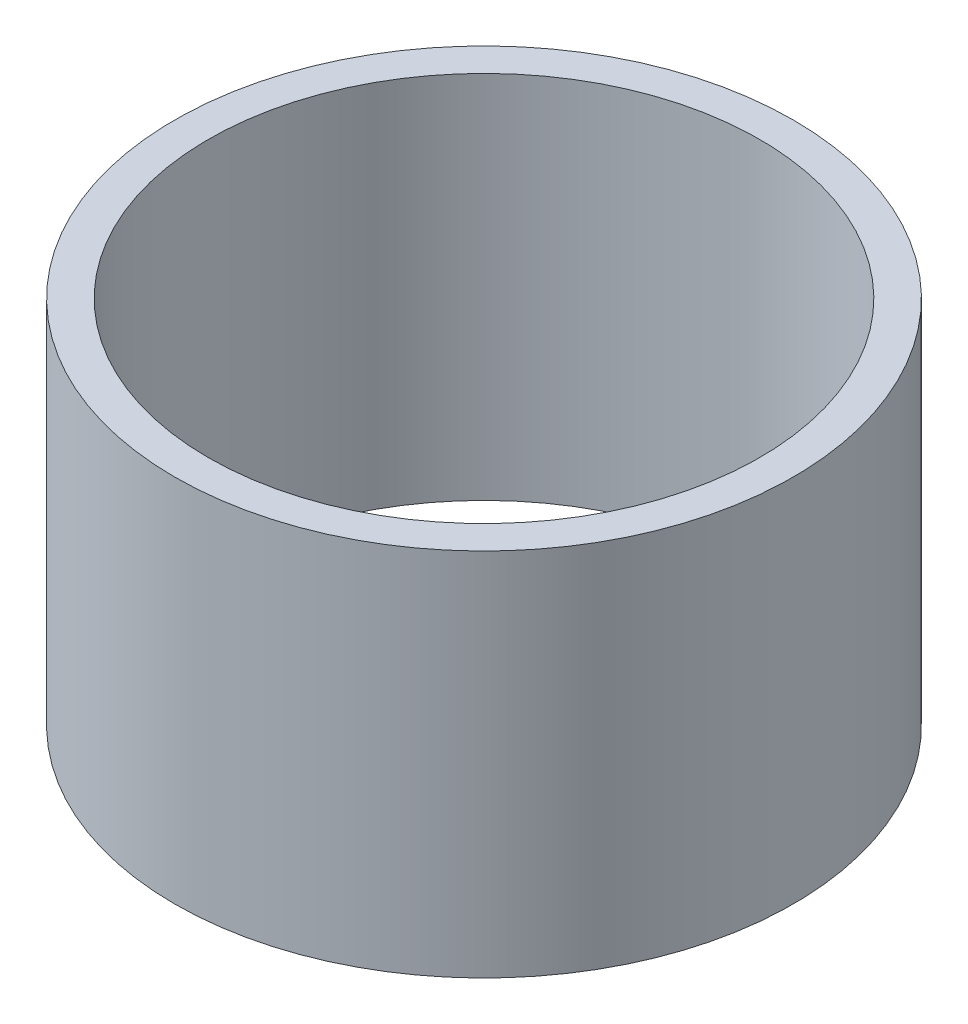
ISO-10303-21;
HEADER;
FILE_DESCRIPTION(('STEP AP214'),'2;1');
FILE_NAME('part.step','',(''),(''),'','','');
FILE_SCHEMA(('AUTOMOTIVE_DESIGN { 1 0 10303 214 1 1 1 1 }'));
ENDSEC;
DATA;
#1=APPLICATION_CONTEXT('core data for automotive mechanical design processes');
#2=APPLICATION_PROTOCOL_DEFINITION('international standard','automotive_design',2000,#1);
#3=PRODUCT_CONTEXT('',#1,'mechanical');
#4=PRODUCT('Part','Part','',(#3));
#5=PRODUCT_RELATED_PRODUCT_CATEGORY('part','',(#4));
#6=PRODUCT_DEFINITION_FORMATION('','',#4);
#7=PRODUCT_DEFINITION_CONTEXT('part definition',#1,'design');
#8=PRODUCT_DEFINITION('design','',#6,#7);
#9=PRODUCT_DEFINITION_SHAPE('','',#8);
#10=(LENGTH_UNIT() NAMED_UNIT(*) SI_UNIT(.MILLI.,.METRE.));
#11=(NAMED_UNIT(*) PLANE_ANGLE_UNIT() SI_UNIT($,.RADIAN.));
#12=(NAMED_UNIT(*) SI_UNIT($,.STERADIAN.) SOLID_ANGLE_UNIT());
#13=UNCERTAINTY_MEASURE_WITH_UNIT(LENGTH_MEASURE(1.E-05),#10,'distance_accuracy_value','');
#14=(GEOMETRIC_REPRESENTATION_CONTEXT(3) GLOBAL_UNCERTAINTY_ASSIGNED_CONTEXT((#13)) GLOBAL_UNIT_ASSIGNED_CONTEXT((#10,
#11,#12)) REPRESENTATION_CONTEXT('',''));
#15=CARTESIAN_POINT('',(0.,0.,0.));
#16=DIRECTION('',(0.,0.,1.));
#17=DIRECTION('',(1.,0.,0.));
#18=AXIS2_PLACEMENT_3D('',#15,#16,#17);
#19=CARTESIAN_POINT('',(0.,27.5,0.));
#20=DIRECTION('',(0.,1.,0.));
#21=DIRECTION('',(0.,0.,1.));
#22=AXIS2_PLACEMENT_3D('',#19,#20,#21);
#23=PLANE('',#22);
#24=CARTESIAN_POINT('',(0.,27.5,0.));
#25=DIRECTION('',(0.,1.,0.));
#26=DIRECTION('',(0.,0.,1.));
#27=AXIS2_PLACEMENT_3D('',#24,#25,#26);
#28=CIRCLE('',#27,23.);
#29=CARTESIAN_POINT('',(0.,27.5,23.));
#30=VERTEX_POINT('',#29);
#31=EDGE_CURVE('E10',#30,#30,#28,.T.);
#32=ORIENTED_EDGE('',*,*,#31,.T.);
#33=EDGE_LOOP('',(#32));
#34=FACE_BOUND('',#33,.T.);
#35=CARTESIAN_POINT('',(0.,27.5,0.));
#36=DIRECTION('',(0.,1.,0.));
#37=DIRECTION('',(0.,0.,1.));
#38=AXIS2_PLACEMENT_3D('',#35,#36,#37);
#39=CIRCLE('',#38,20.5);
#40=CARTESIAN_POINT('',(0.,27.5,20.5));
#41=VERTEX_POINT('',#40);
#42=EDGE_CURVE('E52',#41,#41,#39,.T.);
#43=ORIENTED_EDGE('',*,*,#42,.F.);
#44=EDGE_LOOP('',(#43));
#45=FACE_BOUND('',#44,.T.);
#46=ADVANCED_FACE('F39',(#34,#45),#23,.T.);
#47=CARTESIAN_POINT('',(0.,0.,0.));
#48=DIRECTION('',(0.,1.,0.));
#49=DIRECTION('',(0.,0.,1.));
#50=AXIS2_PLACEMENT_3D('',#47,#48,#49);
#51=PLANE('',#50);
#52=CARTESIAN_POINT('',(0.,0.,0.));
#53=DIRECTION('',(0.,1.,0.));
#54=DIRECTION('',(0.,0.,1.));
#55=AXIS2_PLACEMENT_3D('',#52,#53,#54);
#56=CIRCLE('',#55,23.);
#57=CARTESIAN_POINT('',(0.,0.,23.));
#58=VERTEX_POINT('',#57);
#59=EDGE_CURVE('E43',#58,#58,#56,.T.);
#60=ORIENTED_EDGE('',*,*,#59,.F.);
#61=EDGE_LOOP('',(#60));
#62=FACE_BOUND('',#61,.T.);
#63=CARTESIAN_POINT('',(0.,0.,0.));
#64=DIRECTION('',(0.,1.,0.));
#65=DIRECTION('',(0.,0.,1.));
#66=AXIS2_PLACEMENT_3D('',#63,#64,#65);
#67=CIRCLE('',#66,20.5);
#68=CARTESIAN_POINT('',(0.,0.,20.5));
#69=VERTEX_POINT('',#68);
#70=EDGE_CURVE('E54',#69,#69,#67,.T.);
#71=ORIENTED_EDGE('',*,*,#70,.T.);
#72=EDGE_LOOP('',(#71));
#73=FACE_BOUND('',#72,.T.);
#74=ADVANCED_FACE('F66',(#62,#73),#51,.F.);
#75=CARTESIAN_POINT('',(0.,27.5,0.));
#76=DIRECTION('',(0.,-1.,0.));
#77=DIRECTION('',(0.,0.,-1.));
#78=AXIS2_PLACEMENT_3D('',#75,#76,#77);
#79=CYLINDRICAL_SURFACE('',#78,23.);
#80=ORIENTED_EDGE('',*,*,#31,.F.);
#81=EDGE_LOOP('',(#80));
#82=FACE_BOUND('',#81,.T.);
#83=ORIENTED_EDGE('',*,*,#59,.T.);
#84=EDGE_LOOP('',(#83));
#85=FACE_BOUND('',#84,.T.);
#86=ADVANCED_FACE('F41',(#82,#85),#79,.T.);
#87=CARTESIAN_POINT('',(0.,27.5,0.));
#88=DIRECTION('',(0.,-1.,0.));
#89=DIRECTION('',(0.,0.,-1.));
#90=AXIS2_PLACEMENT_3D('',#87,#88,#89);
#91=CYLINDRICAL_SURFACE('',#90,20.5);
#92=ORIENTED_EDGE('',*,*,#42,.T.);
#93=EDGE_LOOP('',(#92));
#94=FACE_BOUND('',#93,.T.);
#95=ORIENTED_EDGE('',*,*,#70,.F.);
#96=EDGE_LOOP('',(#95));
#97=FACE_BOUND('',#96,.T.);
#98=ADVANCED_FACE('F62',(#94,#97),#91,.F.);
#99=CLOSED_SHELL('',(#46,#74,#86,#98));
#100=MANIFOLD_SOLID_BREP('B2',#99);
#101=ADVANCED_BREP_SHAPE_REPRESENTATION('',(#18,#100),#14);
#102=SHAPE_DEFINITION_REPRESENTATION(#9,#101);
ENDSEC;
END-ISO-10303-21;
